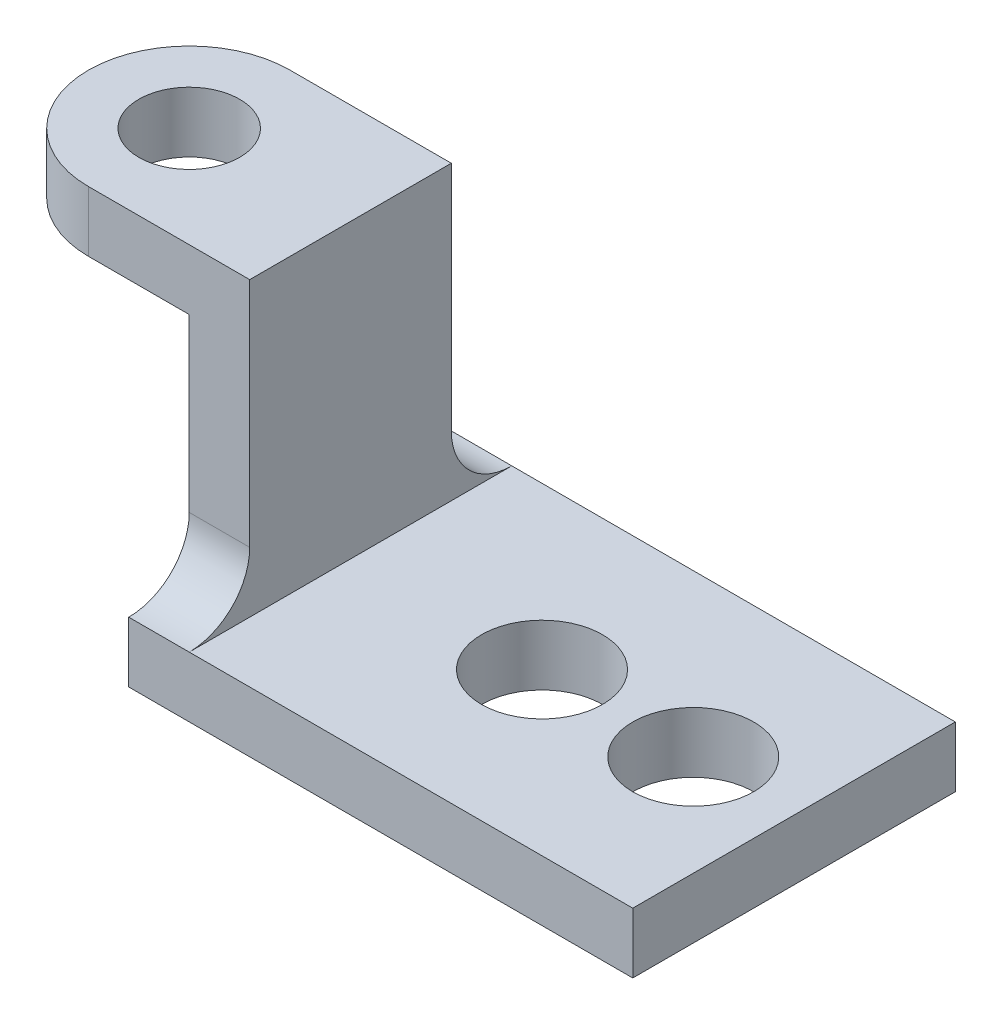
ISO-10303-21;
HEADER;
FILE_DESCRIPTION(('STEP AP214'),'2;1');
FILE_NAME('part.step','',(''),(''),'','','');
FILE_SCHEMA(('AUTOMOTIVE_DESIGN { 1 0 10303 214 1 1 1 1 }'));
ENDSEC;
DATA;
#1=APPLICATION_CONTEXT('core data for automotive mechanical design processes');
#2=APPLICATION_PROTOCOL_DEFINITION('international standard','automotive_design',2000,#1);
#3=PRODUCT_CONTEXT('',#1,'mechanical');
#4=PRODUCT('Part','Part','',(#3));
#5=PRODUCT_RELATED_PRODUCT_CATEGORY('part','',(#4));
#6=PRODUCT_DEFINITION_FORMATION('','',#4);
#7=PRODUCT_DEFINITION_CONTEXT('part definition',#1,'design');
#8=PRODUCT_DEFINITION('design','',#6,#7);
#9=PRODUCT_DEFINITION_SHAPE('','',#8);
#10=(LENGTH_UNIT() NAMED_UNIT(*) SI_UNIT(.MILLI.,.METRE.));
#11=(NAMED_UNIT(*) PLANE_ANGLE_UNIT() SI_UNIT($,.RADIAN.));
#12=(NAMED_UNIT(*) SI_UNIT($,.STERADIAN.) SOLID_ANGLE_UNIT());
#13=UNCERTAINTY_MEASURE_WITH_UNIT(LENGTH_MEASURE(1.E-05),#10,'distance_accuracy_value','');
#14=(GEOMETRIC_REPRESENTATION_CONTEXT(3) GLOBAL_UNCERTAINTY_ASSIGNED_CONTEXT((#13)) GLOBAL_UNIT_ASSIGNED_CONTEXT((#10,
#11,#12)) REPRESENTATION_CONTEXT('',''));
#15=CARTESIAN_POINT('',(0.,0.,0.));
#16=DIRECTION('',(0.,0.,1.));
#17=DIRECTION('',(1.,0.,0.));
#18=AXIS2_PLACEMENT_3D('',#15,#16,#17);
#19=CARTESIAN_POINT('',(-50.,12.,-32.));
#20=DIRECTION('',(0.,0.,-1.));
#21=DIRECTION('',(-1.,0.,0.));
#22=AXIS2_PLACEMENT_3D('',#19,#20,#21);
#23=PLANE('',#22);
#24=DIRECTION('',(1.,0.,0.));
#25=VECTOR('',#24,1.);
#26=CARTESIAN_POINT('',(-50.,0.,-32.));
#27=LINE('',#26,#25);
#28=CARTESIAN_POINT('',(-50.,0.,-32.));
#29=VERTEX_POINT('',#28);
#30=CARTESIAN_POINT('',(50.,0.,-32.));
#31=VERTEX_POINT('',#30);
#32=EDGE_CURVE('E188',#29,#31,#27,.T.);
#33=ORIENTED_EDGE('',*,*,#32,.F.);
#34=DIRECTION('',(0.,-1.,0.));
#35=VECTOR('',#34,1.);
#36=CARTESIAN_POINT('',(-50.,12.,-32.));
#37=LINE('',#36,#35);
#38=CARTESIAN_POINT('',(-50.,12.,-32.));
#39=VERTEX_POINT('',#38);
#40=EDGE_CURVE('E210',#39,#29,#37,.T.);
#41=ORIENTED_EDGE('',*,*,#40,.F.);
#42=DIRECTION('',(1.,0.,0.));
#43=VECTOR('',#42,1.);
#44=CARTESIAN_POINT('',(-50.,12.,-32.));
#45=LINE('',#44,#43);
#46=CARTESIAN_POINT('',(-38.,12.,-32.));
#47=VERTEX_POINT('',#46);
#48=EDGE_CURVE('E189',#39,#47,#45,.T.);
#49=ORIENTED_EDGE('',*,*,#48,.T.);
#50=CARTESIAN_POINT('',(50.,12.,-32.));
#51=VERTEX_POINT('',#50);
#52=EDGE_CURVE('E193',#47,#51,#45,.T.);
#53=ORIENTED_EDGE('',*,*,#52,.T.);
#54=DIRECTION('',(0.,-1.,0.));
#55=VECTOR('',#54,1.);
#56=CARTESIAN_POINT('',(50.,12.,-32.));
#57=LINE('',#56,#55);
#58=EDGE_CURVE('E199',#51,#31,#57,.T.);
#59=ORIENTED_EDGE('',*,*,#58,.T.);
#60=EDGE_LOOP('',(#33,#41,#49,#53,#59));
#61=FACE_BOUND('',#60,.T.);
#62=ADVANCED_FACE('F39',(#61),#23,.T.);
#63=CARTESIAN_POINT('',(-50.,12.,32.));
#64=DIRECTION('',(-1.,0.,0.));
#65=DIRECTION('',(0.,0.,1.));
#66=AXIS2_PLACEMENT_3D('',#63,#64,#65);
#67=PLANE('',#66);
#68=DIRECTION('',(0.,0.,-1.));
#69=VECTOR('',#68,1.);
#70=CARTESIAN_POINT('',(-50.,0.,32.));
#71=LINE('',#70,#69);
#72=CARTESIAN_POINT('',(-50.,0.,32.));
#73=VERTEX_POINT('',#72);
#74=EDGE_CURVE('E207',#73,#29,#71,.T.);
#75=ORIENTED_EDGE('',*,*,#74,.F.);
#76=DIRECTION('',(0.,-1.,0.));
#77=VECTOR('',#76,1.);
#78=CARTESIAN_POINT('',(-50.,12.,32.));
#79=LINE('',#78,#77);
#80=CARTESIAN_POINT('',(-50.,12.,32.));
#81=VERTEX_POINT('',#80);
#82=EDGE_CURVE('E213',#81,#73,#79,.T.);
#83=ORIENTED_EDGE('',*,*,#82,.F.);
#84=CARTESIAN_POINT('',(-50.,24.,32.));
#85=DIRECTION('',(-1.,0.,0.));
#86=DIRECTION('',(0.,0.,1.));
#87=AXIS2_PLACEMENT_3D('',#84,#85,#86);
#88=CIRCLE('',#87,12.);
#89=CARTESIAN_POINT('',(-50.,24.,20.));
#90=VERTEX_POINT('',#89);
#91=EDGE_CURVE('E11',#81,#90,#88,.F.);
#92=ORIENTED_EDGE('',*,*,#91,.T.);
#93=DIRECTION('',(0.,-1.,0.));
#94=VECTOR('',#93,1.);
#95=CARTESIAN_POINT('',(-50.,58.,20.));
#96=LINE('',#95,#94);
#97=CARTESIAN_POINT('',(-50.,58.,20.));
#98=VERTEX_POINT('',#97);
#99=EDGE_CURVE('E174',#98,#90,#96,.T.);
#100=ORIENTED_EDGE('',*,*,#99,.F.);
#101=DIRECTION('',(0.,0.,1.));
#102=VECTOR('',#101,1.);
#103=CARTESIAN_POINT('',(-50.,58.,-20.));
#104=LINE('',#103,#102);
#105=CARTESIAN_POINT('',(-50.,58.,-20.));
#106=VERTEX_POINT('',#105);
#107=EDGE_CURVE('E162',#106,#98,#104,.T.);
#108=ORIENTED_EDGE('',*,*,#107,.F.);
#109=DIRECTION('',(0.,-1.,0.));
#110=VECTOR('',#109,1.);
#111=CARTESIAN_POINT('',(-50.,58.,-20.));
#112=LINE('',#111,#110);
#113=CARTESIAN_POINT('',(-50.,24.,-20.));
#114=VERTEX_POINT('',#113);
#115=EDGE_CURVE('E165',#106,#114,#112,.T.);
#116=ORIENTED_EDGE('',*,*,#115,.T.);
#117=CARTESIAN_POINT('',(-50.,24.,-32.));
#118=DIRECTION('',(-1.,0.,0.));
#119=DIRECTION('',(0.,0.,1.));
#120=AXIS2_PLACEMENT_3D('',#117,#118,#119);
#121=CIRCLE('',#120,12.);
#122=EDGE_CURVE('E223',#114,#39,#121,.F.);
#123=ORIENTED_EDGE('',*,*,#122,.T.);
#124=ORIENTED_EDGE('',*,*,#40,.T.);
#125=EDGE_LOOP('',(#75,#83,#92,#100,#108,#116,#123,#124));
#126=FACE_BOUND('',#125,.T.);
#127=ADVANCED_FACE('F240',(#126),#67,.T.);
#128=CARTESIAN_POINT('',(-50.,12.,32.));
#129=DIRECTION('',(0.,0.,-1.));
#130=DIRECTION('',(-1.,0.,0.));
#131=AXIS2_PLACEMENT_3D('',#128,#129,#130);
#132=PLANE('',#131);
#133=DIRECTION('',(1.,0.,0.));
#134=VECTOR('',#133,1.);
#135=CARTESIAN_POINT('',(-50.,0.,32.));
#136=LINE('',#135,#134);
#137=CARTESIAN_POINT('',(50.,0.,32.));
#138=VERTEX_POINT('',#137);
#139=EDGE_CURVE('E205',#73,#138,#136,.T.);
#140=ORIENTED_EDGE('',*,*,#139,.T.);
#141=DIRECTION('',(0.,-1.,0.));
#142=VECTOR('',#141,1.);
#143=CARTESIAN_POINT('',(50.,12.,32.));
#144=LINE('',#143,#142);
#145=CARTESIAN_POINT('',(50.,12.,32.));
#146=VERTEX_POINT('',#145);
#147=EDGE_CURVE('E215',#146,#138,#144,.T.);
#148=ORIENTED_EDGE('',*,*,#147,.F.);
#149=DIRECTION('',(1.,0.,0.));
#150=VECTOR('',#149,1.);
#151=CARTESIAN_POINT('',(-50.,12.,32.));
#152=LINE('',#151,#150);
#153=CARTESIAN_POINT('',(-38.,12.,32.));
#154=VERTEX_POINT('',#153);
#155=EDGE_CURVE('E196',#154,#146,#152,.T.);
#156=ORIENTED_EDGE('',*,*,#155,.F.);
#157=EDGE_CURVE('E197',#81,#154,#152,.T.);
#158=ORIENTED_EDGE('',*,*,#157,.F.);
#159=ORIENTED_EDGE('',*,*,#82,.T.);
#160=EDGE_LOOP('',(#140,#148,#156,#158,#159));
#161=FACE_BOUND('',#160,.T.);
#162=ADVANCED_FACE('F233',(#161),#132,.F.);
#163=CARTESIAN_POINT('',(50.,12.,32.));
#164=DIRECTION('',(-1.,0.,0.));
#165=DIRECTION('',(0.,0.,1.));
#166=AXIS2_PLACEMENT_3D('',#163,#164,#165);
#167=PLANE('',#166);
#168=DIRECTION('',(0.,0.,-1.));
#169=VECTOR('',#168,1.);
#170=CARTESIAN_POINT('',(50.,0.,32.));
#171=LINE('',#170,#169);
#172=EDGE_CURVE('E202',#138,#31,#171,.T.);
#173=ORIENTED_EDGE('',*,*,#172,.T.);
#174=ORIENTED_EDGE('',*,*,#58,.F.);
#175=DIRECTION('',(0.,0.,-1.));
#176=VECTOR('',#175,1.);
#177=CARTESIAN_POINT('',(50.,12.,32.));
#178=LINE('',#177,#176);
#179=EDGE_CURVE('E192',#146,#51,#178,.T.);
#180=ORIENTED_EDGE('',*,*,#179,.F.);
#181=ORIENTED_EDGE('',*,*,#147,.T.);
#182=EDGE_LOOP('',(#173,#174,#180,#181));
#183=FACE_BOUND('',#182,.T.);
#184=ADVANCED_FACE('F257',(#183),#167,.F.);
#185=CARTESIAN_POINT('',(0.,12.,0.));
#186=DIRECTION('',(0.,1.,0.));
#187=DIRECTION('',(0.,0.,1.));
#188=AXIS2_PLACEMENT_3D('',#185,#186,#187);
#189=PLANE('',#188);
#190=ORIENTED_EDGE('',*,*,#52,.F.);
#191=DIRECTION('',(0.,0.,-1.));
#192=VECTOR('',#191,1.);
#193=CARTESIAN_POINT('',(-38.,12.,-20.));
#194=LINE('',#193,#192);
#195=EDGE_CURVE('E143',#154,#47,#194,.T.);
#196=ORIENTED_EDGE('',*,*,#195,.F.);
#197=ORIENTED_EDGE('',*,*,#155,.T.);
#198=ORIENTED_EDGE('',*,*,#179,.T.);
#199=EDGE_LOOP('',(#190,#196,#197,#198));
#200=FACE_BOUND('',#199,.T.);
#201=CARTESIAN_POINT('',(0.,12.,0.));
#202=DIRECTION('',(0.,1.,0.));
#203=DIRECTION('',(0.,0.,1.));
#204=AXIS2_PLACEMENT_3D('',#201,#202,#203);
#205=CIRCLE('',#204,12.);
#206=CARTESIAN_POINT('',(0.,12.,12.));
#207=VERTEX_POINT('',#206);
#208=EDGE_CURVE('E185',#207,#207,#205,.T.);
#209=ORIENTED_EDGE('',*,*,#208,.F.);
#210=EDGE_LOOP('',(#209));
#211=FACE_BOUND('',#210,.T.);
#212=CARTESIAN_POINT('',(30.,12.,0.));
#213=DIRECTION('',(0.,1.,0.));
#214=DIRECTION('',(0.,0.,1.));
#215=AXIS2_PLACEMENT_3D('',#212,#213,#214);
#216=CIRCLE('',#215,12.);
#217=CARTESIAN_POINT('',(30.,12.,12.));
#218=VERTEX_POINT('',#217);
#219=EDGE_CURVE('E180',#218,#218,#216,.T.);
#220=ORIENTED_EDGE('',*,*,#219,.F.);
#221=EDGE_LOOP('',(#220));
#222=FACE_BOUND('',#221,.T.);
#223=ADVANCED_FACE('F258',(#200,#211,#222),#189,.T.);
#224=CARTESIAN_POINT('',(0.,0.,0.));
#225=DIRECTION('',(0.,1.,0.));
#226=DIRECTION('',(0.,0.,1.));
#227=AXIS2_PLACEMENT_3D('',#224,#225,#226);
#228=PLANE('',#227);
#229=CARTESIAN_POINT('',(0.,0.,0.));
#230=DIRECTION('',(0.,1.,0.));
#231=DIRECTION('',(0.,0.,1.));
#232=AXIS2_PLACEMENT_3D('',#229,#230,#231);
#233=CIRCLE('',#232,12.);
#234=CARTESIAN_POINT('',(0.,0.,12.));
#235=VERTEX_POINT('',#234);
#236=EDGE_CURVE('E177',#235,#235,#233,.T.);
#237=ORIENTED_EDGE('',*,*,#236,.T.);
#238=EDGE_LOOP('',(#237));
#239=FACE_BOUND('',#238,.T.);
#240=CARTESIAN_POINT('',(30.,0.,0.));
#241=DIRECTION('',(0.,1.,0.));
#242=DIRECTION('',(0.,0.,1.));
#243=AXIS2_PLACEMENT_3D('',#240,#241,#242);
#244=CIRCLE('',#243,12.);
#245=CARTESIAN_POINT('',(30.,0.,12.));
#246=VERTEX_POINT('',#245);
#247=EDGE_CURVE('E176',#246,#246,#244,.T.);
#248=ORIENTED_EDGE('',*,*,#247,.T.);
#249=EDGE_LOOP('',(#248));
#250=FACE_BOUND('',#249,.T.);
#251=ORIENTED_EDGE('',*,*,#32,.T.);
#252=ORIENTED_EDGE('',*,*,#172,.F.);
#253=ORIENTED_EDGE('',*,*,#139,.F.);
#254=ORIENTED_EDGE('',*,*,#74,.T.);
#255=EDGE_LOOP('',(#251,#252,#253,#254));
#256=FACE_BOUND('',#255,.T.);
#257=ADVANCED_FACE('F255',(#239,#250,#256),#228,.F.);
#258=CARTESIAN_POINT('',(30.,0.,0.));
#259=DIRECTION('',(0.,1.,0.));
#260=DIRECTION('',(0.,0.,1.));
#261=AXIS2_PLACEMENT_3D('',#258,#259,#260);
#262=CYLINDRICAL_SURFACE('',#261,12.);
#263=ORIENTED_EDGE('',*,*,#219,.T.);
#264=EDGE_LOOP('',(#263));
#265=FACE_BOUND('',#264,.T.);
#266=ORIENTED_EDGE('',*,*,#247,.F.);
#267=EDGE_LOOP('',(#266));
#268=FACE_BOUND('',#267,.T.);
#269=ADVANCED_FACE('F266',(#265,#268),#262,.F.);
#270=CARTESIAN_POINT('',(0.,0.,0.));
#271=DIRECTION('',(0.,1.,0.));
#272=DIRECTION('',(0.,0.,1.));
#273=AXIS2_PLACEMENT_3D('',#270,#271,#272);
#274=CYLINDRICAL_SURFACE('',#273,12.);
#275=ORIENTED_EDGE('',*,*,#208,.T.);
#276=EDGE_LOOP('',(#275));
#277=FACE_BOUND('',#276,.T.);
#278=ORIENTED_EDGE('',*,*,#236,.F.);
#279=EDGE_LOOP('',(#278));
#280=FACE_BOUND('',#279,.T.);
#281=ADVANCED_FACE('F269',(#277,#280),#274,.F.);
#282=CARTESIAN_POINT('',(-50.,58.,20.));
#283=DIRECTION('',(0.,0.,-1.));
#284=DIRECTION('',(-1.,0.,0.));
#285=AXIS2_PLACEMENT_3D('',#282,#283,#284);
#286=PLANE('',#285);
#287=ORIENTED_EDGE('',*,*,#99,.T.);
#288=DIRECTION('',(1.,0.,0.));
#289=VECTOR('',#288,1.);
#290=CARTESIAN_POINT('',(-50.,24.,20.));
#291=LINE('',#290,#289);
#292=CARTESIAN_POINT('',(-38.,24.,20.));
#293=VERTEX_POINT('',#292);
#294=EDGE_CURVE('E221',#90,#293,#291,.T.);
#295=ORIENTED_EDGE('',*,*,#294,.T.);
#296=DIRECTION('',(0.,-1.,0.));
#297=VECTOR('',#296,1.);
#298=CARTESIAN_POINT('',(-38.,58.,20.));
#299=LINE('',#298,#297);
#300=CARTESIAN_POINT('',(-38.,70.,20.));
#301=VERTEX_POINT('',#300);
#302=EDGE_CURVE('E171',#301,#293,#299,.T.);
#303=ORIENTED_EDGE('',*,*,#302,.F.);
#304=DIRECTION('',(1.,0.,0.));
#305=VECTOR('',#304,1.);
#306=CARTESIAN_POINT('',(-50.,70.,20.));
#307=LINE('',#306,#305);
#308=CARTESIAN_POINT('',(-70.,70.,20.));
#309=VERTEX_POINT('',#308);
#310=EDGE_CURVE('E149',#309,#301,#307,.T.);
#311=ORIENTED_EDGE('',*,*,#310,.F.);
#312=DIRECTION('',(0.,-1.,0.));
#313=VECTOR('',#312,1.);
#314=CARTESIAN_POINT('',(-70.,70.,20.));
#315=LINE('',#314,#313);
#316=CARTESIAN_POINT('',(-70.,58.,20.));
#317=VERTEX_POINT('',#316);
#318=EDGE_CURVE('E144',#309,#317,#315,.T.);
#319=ORIENTED_EDGE('',*,*,#318,.T.);
#320=DIRECTION('',(1.,0.,0.));
#321=VECTOR('',#320,1.);
#322=CARTESIAN_POINT('',(-50.,58.,20.));
#323=LINE('',#322,#321);
#324=EDGE_CURVE('E133',#317,#98,#323,.T.);
#325=ORIENTED_EDGE('',*,*,#324,.T.);
#326=EDGE_LOOP('',(#287,#295,#303,#311,#319,#325));
#327=FACE_BOUND('',#326,.T.);
#328=ADVANCED_FACE('F237',(#327),#286,.F.);
#329=CARTESIAN_POINT('',(-38.,58.,-20.));
#330=DIRECTION('',(-1.,0.,0.));
#331=DIRECTION('',(0.,0.,1.));
#332=AXIS2_PLACEMENT_3D('',#329,#330,#331);
#333=PLANE('',#332);
#334=ORIENTED_EDGE('',*,*,#195,.T.);
#335=CARTESIAN_POINT('',(-38.,24.,-32.));
#336=DIRECTION('',(-1.,0.,0.));
#337=DIRECTION('',(0.,0.,1.));
#338=AXIS2_PLACEMENT_3D('',#335,#336,#337);
#339=CIRCLE('',#338,12.);
#340=CARTESIAN_POINT('',(-38.,24.,-20.));
#341=VERTEX_POINT('',#340);
#342=EDGE_CURVE('E225',#47,#341,#339,.T.);
#343=ORIENTED_EDGE('',*,*,#342,.T.);
#344=DIRECTION('',(0.,-1.,0.));
#345=VECTOR('',#344,1.);
#346=CARTESIAN_POINT('',(-38.,58.,-20.));
#347=LINE('',#346,#345);
#348=CARTESIAN_POINT('',(-38.,70.,-20.));
#349=VERTEX_POINT('',#348);
#350=EDGE_CURVE('E169',#349,#341,#347,.T.);
#351=ORIENTED_EDGE('',*,*,#350,.F.);
#352=DIRECTION('',(0.,0.,-1.));
#353=VECTOR('',#352,1.);
#354=CARTESIAN_POINT('',(-38.,70.,20.));
#355=LINE('',#354,#353);
#356=EDGE_CURVE('E130',#301,#349,#355,.T.);
#357=ORIENTED_EDGE('',*,*,#356,.F.);
#358=ORIENTED_EDGE('',*,*,#302,.T.);
#359=CARTESIAN_POINT('',(-38.,24.,32.));
#360=DIRECTION('',(-1.,0.,0.));
#361=DIRECTION('',(0.,0.,1.));
#362=AXIS2_PLACEMENT_3D('',#359,#360,#361);
#363=CIRCLE('',#362,12.);
#364=EDGE_CURVE('E47',#293,#154,#363,.T.);
#365=ORIENTED_EDGE('',*,*,#364,.T.);
#366=EDGE_LOOP('',(#334,#343,#351,#357,#358,#365));
#367=FACE_BOUND('',#366,.T.);
#368=ADVANCED_FACE('F228',(#367),#333,.F.);
#369=CARTESIAN_POINT('',(-50.,58.,-20.));
#370=DIRECTION('',(0.,0.,1.));
#371=DIRECTION('',(1.,0.,0.));
#372=AXIS2_PLACEMENT_3D('',#369,#370,#371);
#373=PLANE('',#372);
#374=ORIENTED_EDGE('',*,*,#350,.T.);
#375=DIRECTION('',(-1.,0.,0.));
#376=VECTOR('',#375,1.);
#377=CARTESIAN_POINT('',(-50.,24.,-20.));
#378=LINE('',#377,#376);
#379=EDGE_CURVE('E212',#341,#114,#378,.T.);
#380=ORIENTED_EDGE('',*,*,#379,.T.);
#381=ORIENTED_EDGE('',*,*,#115,.F.);
#382=DIRECTION('',(-1.,0.,0.));
#383=VECTOR('',#382,1.);
#384=CARTESIAN_POINT('',(-50.,58.,-20.));
#385=LINE('',#384,#383);
#386=CARTESIAN_POINT('',(-70.,58.,-20.));
#387=VERTEX_POINT('',#386);
#388=EDGE_CURVE('E139',#106,#387,#385,.T.);
#389=ORIENTED_EDGE('',*,*,#388,.T.);
#390=DIRECTION('',(0.,-1.,0.));
#391=VECTOR('',#390,1.);
#392=CARTESIAN_POINT('',(-70.,70.,-20.));
#393=LINE('',#392,#391);
#394=CARTESIAN_POINT('',(-70.,70.,-20.));
#395=VERTEX_POINT('',#394);
#396=EDGE_CURVE('E136',#395,#387,#393,.T.);
#397=ORIENTED_EDGE('',*,*,#396,.F.);
#398=DIRECTION('',(-1.,0.,0.));
#399=VECTOR('',#398,1.);
#400=CARTESIAN_POINT('',(-38.,70.,-20.));
#401=LINE('',#400,#399);
#402=EDGE_CURVE('E121',#349,#395,#401,.T.);
#403=ORIENTED_EDGE('',*,*,#402,.F.);
#404=EDGE_LOOP('',(#374,#380,#381,#389,#397,#403));
#405=FACE_BOUND('',#404,.T.);
#406=ADVANCED_FACE('F137',(#405),#373,.F.);
#407=CARTESIAN_POINT('',(-70.,58.,0.));
#408=DIRECTION('',(0.,1.,0.));
#409=DIRECTION('',(0.,0.,1.));
#410=AXIS2_PLACEMENT_3D('',#407,#408,#409);
#411=PLANE('',#410);
#412=CARTESIAN_POINT('',(-70.,58.,0.));
#413=DIRECTION('',(0.,1.,0.));
#414=DIRECTION('',(0.,0.,1.));
#415=AXIS2_PLACEMENT_3D('',#412,#413,#414);
#416=CIRCLE('',#415,10.);
#417=CARTESIAN_POINT('',(-70.,58.,10.));
#418=VERTEX_POINT('',#417);
#419=EDGE_CURVE('E432',#418,#418,#416,.T.);
#420=ORIENTED_EDGE('',*,*,#419,.T.);
#421=EDGE_LOOP('',(#420));
#422=FACE_BOUND('',#421,.T.);
#423=ORIENTED_EDGE('',*,*,#388,.F.);
#424=ORIENTED_EDGE('',*,*,#107,.T.);
#425=ORIENTED_EDGE('',*,*,#324,.F.);
#426=CARTESIAN_POINT('',(-70.,58.,0.));
#427=DIRECTION('',(0.,1.,0.));
#428=DIRECTION('',(0.,0.,1.));
#429=AXIS2_PLACEMENT_3D('',#426,#427,#428);
#430=CIRCLE('',#429,20.);
#431=EDGE_CURVE('E156',#387,#317,#430,.T.);
#432=ORIENTED_EDGE('',*,*,#431,.F.);
#433=EDGE_LOOP('',(#423,#424,#425,#432));
#434=FACE_BOUND('',#433,.T.);
#435=ADVANCED_FACE('F242',(#422,#434),#411,.F.);
#436=CARTESIAN_POINT('',(-70.,70.,0.));
#437=DIRECTION('',(0.,1.,0.));
#438=DIRECTION('',(0.,0.,1.));
#439=AXIS2_PLACEMENT_3D('',#436,#437,#438);
#440=PLANE('',#439);
#441=ORIENTED_EDGE('',*,*,#402,.T.);
#442=CARTESIAN_POINT('',(-70.,70.,0.));
#443=DIRECTION('',(0.,1.,0.));
#444=DIRECTION('',(0.,0.,1.));
#445=AXIS2_PLACEMENT_3D('',#442,#443,#444);
#446=CIRCLE('',#445,20.);
#447=EDGE_CURVE('E127',#395,#309,#446,.T.);
#448=ORIENTED_EDGE('',*,*,#447,.T.);
#449=ORIENTED_EDGE('',*,*,#310,.T.);
#450=ORIENTED_EDGE('',*,*,#356,.T.);
#451=EDGE_LOOP('',(#441,#448,#449,#450));
#452=FACE_BOUND('',#451,.T.);
#453=CARTESIAN_POINT('',(-70.,70.,0.));
#454=DIRECTION('',(0.,1.,0.));
#455=DIRECTION('',(0.,0.,1.));
#456=AXIS2_PLACEMENT_3D('',#453,#454,#455);
#457=CIRCLE('',#456,10.);
#458=CARTESIAN_POINT('',(-70.,70.,10.));
#459=VERTEX_POINT('',#458);
#460=EDGE_CURVE('E157',#459,#459,#457,.T.);
#461=ORIENTED_EDGE('',*,*,#460,.F.);
#462=EDGE_LOOP('',(#461));
#463=FACE_BOUND('',#462,.T.);
#464=ADVANCED_FACE('F123',(#452,#463),#440,.T.);
#465=CARTESIAN_POINT('',(-70.,70.,0.));
#466=DIRECTION('',(0.,-1.,0.));
#467=DIRECTION('',(0.,0.,-1.));
#468=AXIS2_PLACEMENT_3D('',#465,#466,#467);
#469=CYLINDRICAL_SURFACE('',#468,20.);
#470=ORIENTED_EDGE('',*,*,#431,.T.);
#471=ORIENTED_EDGE('',*,*,#318,.F.);
#472=ORIENTED_EDGE('',*,*,#447,.F.);
#473=ORIENTED_EDGE('',*,*,#396,.T.);
#474=EDGE_LOOP('',(#470,#471,#472,#473));
#475=FACE_BOUND('',#474,.T.);
#476=ADVANCED_FACE('F146',(#475),#469,.T.);
#477=CARTESIAN_POINT('',(-70.,70.,0.));
#478=DIRECTION('',(0.,-1.,0.));
#479=DIRECTION('',(0.,0.,-1.));
#480=AXIS2_PLACEMENT_3D('',#477,#478,#479);
#481=CYLINDRICAL_SURFACE('',#480,10.);
#482=ORIENTED_EDGE('',*,*,#460,.T.);
#483=EDGE_LOOP('',(#482));
#484=FACE_BOUND('',#483,.T.);
#485=ORIENTED_EDGE('',*,*,#419,.F.);
#486=EDGE_LOOP('',(#485));
#487=FACE_BOUND('',#486,.T.);
#488=ADVANCED_FACE('F289',(#484,#487),#481,.F.);
#489=CARTESIAN_POINT('',(-50.,24.,-32.));
#490=DIRECTION('',(-1.,0.,0.));
#491=DIRECTION('',(0.,0.,1.));
#492=AXIS2_PLACEMENT_3D('',#489,#490,#491);
#493=CYLINDRICAL_SURFACE('',#492,12.);
#494=ORIENTED_EDGE('',*,*,#342,.F.);
#495=ORIENTED_EDGE('',*,*,#48,.F.);
#496=ORIENTED_EDGE('',*,*,#122,.F.);
#497=ORIENTED_EDGE('',*,*,#379,.F.);
#498=EDGE_LOOP('',(#494,#495,#496,#497));
#499=FACE_BOUND('',#498,.T.);
#500=ADVANCED_FACE('F246',(#499),#493,.F.);
#501=CARTESIAN_POINT('',(-50.,24.,32.));
#502=DIRECTION('',(1.,0.,0.));
#503=DIRECTION('',(0.,0.,-1.));
#504=AXIS2_PLACEMENT_3D('',#501,#502,#503);
#505=CYLINDRICAL_SURFACE('',#504,12.);
#506=ORIENTED_EDGE('',*,*,#91,.F.);
#507=ORIENTED_EDGE('',*,*,#157,.T.);
#508=ORIENTED_EDGE('',*,*,#364,.F.);
#509=ORIENTED_EDGE('',*,*,#294,.F.);
#510=EDGE_LOOP('',(#506,#507,#508,#509));
#511=FACE_BOUND('',#510,.T.);
#512=ADVANCED_FACE('F41',(#511),#505,.F.);
#513=CLOSED_SHELL('',(#62,#127,#162,#184,#223,#257,#269,#281,#328,#368,#406,#435,#464,#476,#488,
#500,#512));
#514=MANIFOLD_SOLID_BREP('B2',#513);
#515=ADVANCED_BREP_SHAPE_REPRESENTATION('',(#18,#514),#14);
#516=SHAPE_DEFINITION_REPRESENTATION(#9,#515);
ENDSEC;
END-ISO-10303-21;
